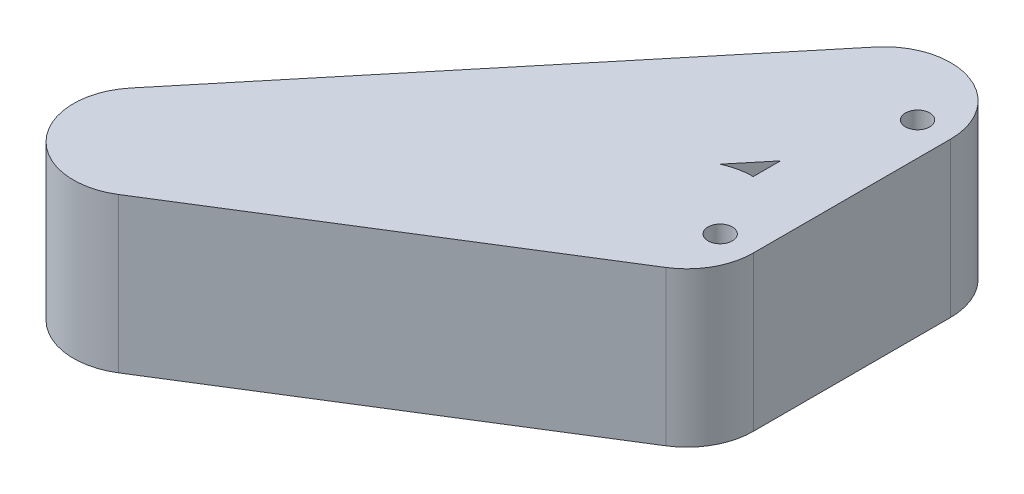
ISO-10303-21;
HEADER;
FILE_DESCRIPTION(('STEP AP214'),'2;1');
FILE_NAME('part.step','',(''),(''),'','','');
FILE_SCHEMA(('AUTOMOTIVE_DESIGN { 1 0 10303 214 1 1 1 1 }'));
ENDSEC;
DATA;
#1=APPLICATION_CONTEXT('core data for automotive mechanical design processes');
#2=APPLICATION_PROTOCOL_DEFINITION('international standard','automotive_design',2000,#1);
#3=PRODUCT_CONTEXT('',#1,'mechanical');
#4=PRODUCT('Part','Part','',(#3));
#5=PRODUCT_RELATED_PRODUCT_CATEGORY('part','',(#4));
#6=PRODUCT_DEFINITION_FORMATION('','',#4);
#7=PRODUCT_DEFINITION_CONTEXT('part definition',#1,'design');
#8=PRODUCT_DEFINITION('design','',#6,#7);
#9=PRODUCT_DEFINITION_SHAPE('','',#8);
#10=(LENGTH_UNIT() NAMED_UNIT(*) SI_UNIT(.MILLI.,.METRE.));
#11=(NAMED_UNIT(*) PLANE_ANGLE_UNIT() SI_UNIT($,.RADIAN.));
#12=(NAMED_UNIT(*) SI_UNIT($,.STERADIAN.) SOLID_ANGLE_UNIT());
#13=UNCERTAINTY_MEASURE_WITH_UNIT(LENGTH_MEASURE(1.E-05),#10,'distance_accuracy_value','');
#14=(GEOMETRIC_REPRESENTATION_CONTEXT(3) GLOBAL_UNCERTAINTY_ASSIGNED_CONTEXT((#13)) GLOBAL_UNIT_ASSIGNED_CONTEXT((#10,
#11,#12)) REPRESENTATION_CONTEXT('',''));
#15=CARTESIAN_POINT('',(0.,0.,0.));
#16=DIRECTION('',(0.,0.,1.));
#17=DIRECTION('',(1.,0.,0.));
#18=AXIS2_PLACEMENT_3D('',#15,#16,#17);
#19=CARTESIAN_POINT('',(-7.49999999999999,35.,0.));
#20=DIRECTION('',(1.,0.,0.));
#21=DIRECTION('',(0.,0.,-1.));
#22=AXIS2_PLACEMENT_3D('',#19,#20,#21);
#23=PLANE('',#22);
#24=DIRECTION('',(0.,1.,0.));
#25=VECTOR('',#24,1.);
#26=CARTESIAN_POINT('',(-7.5,35.,-21.164686488254));
#27=LINE('',#26,#25);
#28=CARTESIAN_POINT('',(-7.5,0.,-21.164686488254));
#29=VERTEX_POINT('',#28);
#30=CARTESIAN_POINT('',(-7.5,35.,-21.164686488254));
#31=VERTEX_POINT('',#30);
#32=EDGE_CURVE('E52',#29,#31,#27,.T.);
#33=ORIENTED_EDGE('',*,*,#32,.F.);
#34=DIRECTION('',(0.,0.,1.));
#35=VECTOR('',#34,1.);
#36=CARTESIAN_POINT('',(-7.49999999999999,0.,0.));
#37=LINE('',#36,#35);
#38=CARTESIAN_POINT('',(-7.5,0.,-15.));
#39=VERTEX_POINT('',#38);
#40=EDGE_CURVE('E181',#29,#39,#37,.T.);
#41=ORIENTED_EDGE('',*,*,#40,.T.);
#42=DIRECTION('',(0.,-1.,0.));
#43=VECTOR('',#42,1.);
#44=CARTESIAN_POINT('',(-7.5,35.,-15.));
#45=LINE('',#44,#43);
#46=CARTESIAN_POINT('',(-7.5,35.,-15.));
#47=VERTEX_POINT('',#46);
#48=EDGE_CURVE('E155',#39,#47,#45,.F.);
#49=ORIENTED_EDGE('',*,*,#48,.T.);
#50=DIRECTION('',(0.,0.,1.));
#51=VECTOR('',#50,1.);
#52=CARTESIAN_POINT('',(-7.49999999999999,35.,0.));
#53=LINE('',#52,#51);
#54=EDGE_CURVE('E48',#31,#47,#53,.T.);
#55=ORIENTED_EDGE('',*,*,#54,.F.);
#56=EDGE_LOOP('',(#33,#41,#49,#55));
#57=FACE_BOUND('',#56,.T.);
#58=ADVANCED_FACE('F33',(#57),#23,.F.);
#59=CARTESIAN_POINT('',(7.50000000000001,35.,0.));
#60=DIRECTION('',(1.,0.,0.));
#61=DIRECTION('',(0.,0.,-1.));
#62=AXIS2_PLACEMENT_3D('',#59,#60,#61);
#63=PLANE('',#62);
#64=DIRECTION('',(0.,0.,1.));
#65=VECTOR('',#64,1.);
#66=CARTESIAN_POINT('',(7.50000000000001,0.,0.));
#67=LINE('',#66,#65);
#68=CARTESIAN_POINT('',(7.5,0.,-44.72));
#69=VERTEX_POINT('',#68);
#70=CARTESIAN_POINT('',(7.50000000000001,0.,0.));
#71=VERTEX_POINT('',#70);
#72=EDGE_CURVE('E169',#69,#71,#67,.T.);
#73=ORIENTED_EDGE('',*,*,#72,.F.);
#74=DIRECTION('',(0.,-1.,0.));
#75=VECTOR('',#74,1.);
#76=CARTESIAN_POINT('',(7.5,35.,-44.72));
#77=LINE('',#76,#75);
#78=CARTESIAN_POINT('',(7.5,35.,-44.72));
#79=VERTEX_POINT('',#78);
#80=EDGE_CURVE('E41',#79,#69,#77,.T.);
#81=ORIENTED_EDGE('',*,*,#80,.F.);
#82=DIRECTION('',(0.,0.,1.));
#83=VECTOR('',#82,1.);
#84=CARTESIAN_POINT('',(7.50000000000001,35.,0.));
#85=LINE('',#84,#83);
#86=CARTESIAN_POINT('',(7.49999999999999,35.,0.));
#87=VERTEX_POINT('',#86);
#88=EDGE_CURVE('E173',#79,#87,#85,.T.);
#89=ORIENTED_EDGE('',*,*,#88,.T.);
#90=DIRECTION('',(0.,-1.,0.));
#91=VECTOR('',#90,1.);
#92=CARTESIAN_POINT('',(7.50000000000001,35.,0.));
#93=LINE('',#92,#91);
#94=EDGE_CURVE('E11',#87,#71,#93,.T.);
#95=ORIENTED_EDGE('',*,*,#94,.T.);
#96=EDGE_LOOP('',(#73,#81,#89,#95));
#97=FACE_BOUND('',#96,.T.);
#98=ADVANCED_FACE('F203',(#97),#63,.T.);
#99=CARTESIAN_POINT('',(0.,35.,0.));
#100=DIRECTION('',(0.,-1.,0.));
#101=DIRECTION('',(0.,0.,-1.));
#102=AXIS2_PLACEMENT_3D('',#99,#100,#101);
#103=CYLINDRICAL_SURFACE('',#102,2.75);
#104=CARTESIAN_POINT('',(0.,35.,0.));
#105=DIRECTION('',(0.,1.,0.));
#106=DIRECTION('',(0.,0.,1.));
#107=AXIS2_PLACEMENT_3D('',#104,#105,#106);
#108=CIRCLE('',#107,2.75);
#109=CARTESIAN_POINT('',(0.,35.,2.75));
#110=VERTEX_POINT('',#109);
#111=EDGE_CURVE('E168',#110,#110,#108,.T.);
#112=ORIENTED_EDGE('',*,*,#111,.T.);
#113=EDGE_LOOP('',(#112));
#114=FACE_BOUND('',#113,.T.);
#115=CARTESIAN_POINT('',(0.,0.,0.));
#116=DIRECTION('',(0.,1.,0.));
#117=DIRECTION('',(0.,0.,1.));
#118=AXIS2_PLACEMENT_3D('',#115,#116,#117);
#119=CIRCLE('',#118,2.75);
#120=CARTESIAN_POINT('',(0.,0.,2.75));
#121=VERTEX_POINT('',#120);
#122=EDGE_CURVE('E178',#121,#121,#119,.T.);
#123=ORIENTED_EDGE('',*,*,#122,.F.);
#124=EDGE_LOOP('',(#123));
#125=FACE_BOUND('',#124,.T.);
#126=ADVANCED_FACE('F225',(#114,#125),#103,.F.);
#127=CARTESIAN_POINT('',(0.,35.,-44.72));
#128=DIRECTION('',(0.,-1.,0.));
#129=DIRECTION('',(0.,0.,-1.));
#130=AXIS2_PLACEMENT_3D('',#127,#128,#129);
#131=CYLINDRICAL_SURFACE('',#130,2.75);
#132=CARTESIAN_POINT('',(0.,35.,-44.72));
#133=DIRECTION('',(0.,1.,0.));
#134=DIRECTION('',(0.,0.,1.));
#135=AXIS2_PLACEMENT_3D('',#132,#133,#134);
#136=CIRCLE('',#135,2.75);
#137=CARTESIAN_POINT('',(0.,35.,-41.97));
#138=VERTEX_POINT('',#137);
#139=EDGE_CURVE('E165',#138,#138,#136,.T.);
#140=ORIENTED_EDGE('',*,*,#139,.T.);
#141=EDGE_LOOP('',(#140));
#142=FACE_BOUND('',#141,.T.);
#143=CARTESIAN_POINT('',(0.,0.,-44.72));
#144=DIRECTION('',(0.,1.,0.));
#145=DIRECTION('',(0.,0.,1.));
#146=AXIS2_PLACEMENT_3D('',#143,#144,#145);
#147=CIRCLE('',#146,2.75);
#148=CARTESIAN_POINT('',(0.,0.,-41.97));
#149=VERTEX_POINT('',#148);
#150=EDGE_CURVE('E164',#149,#149,#147,.T.);
#151=ORIENTED_EDGE('',*,*,#150,.F.);
#152=EDGE_LOOP('',(#151));
#153=FACE_BOUND('',#152,.T.);
#154=ADVANCED_FACE('F35',(#142,#153),#131,.F.);
#155=CARTESIAN_POINT('',(0.,35.,0.));
#156=DIRECTION('',(0.,1.,0.));
#157=DIRECTION('',(0.,0.,1.));
#158=AXIS2_PLACEMENT_3D('',#155,#156,#157);
#159=PLANE('',#158);
#160=DIRECTION('',(0.636798996223087,0.,-0.771029855718486));
#161=VECTOR('',#160,1.);
#162=CARTESIAN_POINT('',(-14.8503241796823,35.,-12.2649874853379));
#163=LINE('',#162,#161);
#164=CARTESIAN_POINT('',(-13.6987999177016,35.,-13.6592415448407));
#165=VERTEX_POINT('',#164);
#166=EDGE_CURVE('E117',#165,#31,#163,.T.);
#167=ORIENTED_EDGE('',*,*,#166,.T.);
#168=ORIENTED_EDGE('',*,*,#54,.T.);
#169=CARTESIAN_POINT('',(-7.49999999999999,35.,0.));
#170=DIRECTION('',(0.,-1.,0.));
#171=DIRECTION('',(0.,0.,-1.));
#172=AXIS2_PLACEMENT_3D('',#169,#170,#171);
#173=CIRCLE('',#172,15.);
#174=EDGE_CURVE('E107',#165,#47,#173,.T.);
#175=ORIENTED_EDGE('',*,*,#174,.F.);
#176=EDGE_LOOP('',(#167,#168,#175));
#177=FACE_BOUND('',#176,.T.);
#178=CARTESIAN_POINT('',(0.448788963497994,35.,12.7207214423464));
#179=VERTEX_POINT('',#178);
#180=EDGE_CURVE('E120',#87,#179,#173,.T.);
#181=ORIENTED_EDGE('',*,*,#180,.F.);
#182=ORIENTED_EDGE('',*,*,#88,.F.);
#183=CARTESIAN_POINT('',(-7.50000000000001,35.,-44.72));
#184=DIRECTION('',(0.,-1.,0.));
#185=DIRECTION('',(0.,0.,-1.));
#186=AXIS2_PLACEMENT_3D('',#183,#184,#185);
#187=CIRCLE('',#186,15.);
#188=CARTESIAN_POINT('',(-19.0654478357773,35.,-54.2719849433463));
#189=VERTEX_POINT('',#188);
#190=EDGE_CURVE('E114',#189,#79,#187,.T.);
#191=ORIENTED_EDGE('',*,*,#190,.F.);
#192=DIRECTION('',(0.636798996223087,0.,-0.771029855718486));
#193=VECTOR('',#192,1.);
#194=CARTESIAN_POINT('',(-37.9812198512369,35.,-31.3689573720305));
#195=LINE('',#194,#193);
#196=CARTESIAN_POINT('',(-95.3897764898559,35.,38.1407488376417));
#197=VERTEX_POINT('',#196);
#198=EDGE_CURVE('E133',#197,#189,#195,.T.);
#199=ORIENTED_EDGE('',*,*,#198,.F.);
#200=CARTESIAN_POINT('',(-83.8243286540786,35.,47.692733780988));
#201=DIRECTION('',(0.,-1.,0.));
#202=DIRECTION('',(0.,0.,-1.));
#203=AXIS2_PLACEMENT_3D('',#200,#201,#202);
#204=CIRCLE('',#203,15.);
#205=CARTESIAN_POINT('',(-75.8755396905806,35.,60.4134552233344));
#206=VERTEX_POINT('',#205);
#207=EDGE_CURVE('E128',#206,#197,#204,.T.);
#208=ORIENTED_EDGE('',*,*,#207,.F.);
#209=DIRECTION('',(0.848048096156429,0.,-0.5299192642332));
#210=VECTOR('',#209,1.);
#211=CARTESIAN_POINT('',(5.84268076395707,35.,9.35024376872457));
#212=LINE('',#211,#210);
#213=EDGE_CURVE('E125',#206,#179,#212,.T.);
#214=ORIENTED_EDGE('',*,*,#213,.T.);
#215=EDGE_LOOP('',(#181,#182,#191,#199,#208,#214));
#216=FACE_BOUND('',#215,.T.);
#217=ORIENTED_EDGE('',*,*,#139,.F.);
#218=EDGE_LOOP('',(#217));
#219=FACE_BOUND('',#218,.T.);
#220=ORIENTED_EDGE('',*,*,#111,.F.);
#221=EDGE_LOOP('',(#220));
#222=FACE_BOUND('',#221,.T.);
#223=ADVANCED_FACE('F123',(#177,#216,#219,#222),#159,.T.);
#224=CARTESIAN_POINT('',(0.,0.,0.));
#225=DIRECTION('',(0.,1.,0.));
#226=DIRECTION('',(0.,0.,1.));
#227=AXIS2_PLACEMENT_3D('',#224,#225,#226);
#228=PLANE('',#227);
#229=ORIENTED_EDGE('',*,*,#40,.F.);
#230=DIRECTION('',(0.636798996223087,0.,-0.771029855718486));
#231=VECTOR('',#230,1.);
#232=CARTESIAN_POINT('',(-14.8503241796823,0.,-12.2649874853379));
#233=LINE('',#232,#231);
#234=CARTESIAN_POINT('',(-13.6987999177016,0.,-13.6592415448407));
#235=VERTEX_POINT('',#234);
#236=EDGE_CURVE('E138',#235,#29,#233,.T.);
#237=ORIENTED_EDGE('',*,*,#236,.F.);
#238=CARTESIAN_POINT('',(-7.49999999999999,0.,0.));
#239=DIRECTION('',(0.,-1.,0.));
#240=DIRECTION('',(0.,0.,-1.));
#241=AXIS2_PLACEMENT_3D('',#238,#239,#240);
#242=CIRCLE('',#241,15.);
#243=EDGE_CURVE('E109',#235,#39,#242,.T.);
#244=ORIENTED_EDGE('',*,*,#243,.T.);
#245=EDGE_LOOP('',(#229,#237,#244));
#246=FACE_BOUND('',#245,.T.);
#247=ORIENTED_EDGE('',*,*,#72,.T.);
#248=CARTESIAN_POINT('',(0.448788963497994,0.,12.7207214423464));
#249=VERTEX_POINT('',#248);
#250=EDGE_CURVE('E140',#71,#249,#242,.T.);
#251=ORIENTED_EDGE('',*,*,#250,.T.);
#252=DIRECTION('',(0.848048096156429,0.,-0.5299192642332));
#253=VECTOR('',#252,1.);
#254=CARTESIAN_POINT('',(5.84268076395707,0.,9.35024376872457));
#255=LINE('',#254,#253);
#256=CARTESIAN_POINT('',(-75.8755396905806,0.,60.4134552233344));
#257=VERTEX_POINT('',#256);
#258=EDGE_CURVE('E142',#257,#249,#255,.T.);
#259=ORIENTED_EDGE('',*,*,#258,.F.);
#260=CARTESIAN_POINT('',(-83.8243286540786,0.,47.692733780988));
#261=DIRECTION('',(0.,-1.,0.));
#262=DIRECTION('',(0.,0.,-1.));
#263=AXIS2_PLACEMENT_3D('',#260,#261,#262);
#264=CIRCLE('',#263,15.);
#265=CARTESIAN_POINT('',(-95.3897764898559,0.,38.1407488376417));
#266=VERTEX_POINT('',#265);
#267=EDGE_CURVE('E145',#257,#266,#264,.T.);
#268=ORIENTED_EDGE('',*,*,#267,.T.);
#269=DIRECTION('',(0.636798996223087,0.,-0.771029855718486));
#270=VECTOR('',#269,1.);
#271=CARTESIAN_POINT('',(-37.9812198512369,0.,-31.3689573720305));
#272=LINE('',#271,#270);
#273=CARTESIAN_POINT('',(-19.0654478357773,0.,-54.2719849433463));
#274=VERTEX_POINT('',#273);
#275=EDGE_CURVE('E148',#266,#274,#272,.T.);
#276=ORIENTED_EDGE('',*,*,#275,.T.);
#277=CARTESIAN_POINT('',(-7.50000000000001,0.,-44.72));
#278=DIRECTION('',(0.,-1.,0.));
#279=DIRECTION('',(0.,0.,-1.));
#280=AXIS2_PLACEMENT_3D('',#277,#278,#279);
#281=CIRCLE('',#280,15.);
#282=EDGE_CURVE('E121',#274,#69,#281,.T.);
#283=ORIENTED_EDGE('',*,*,#282,.T.);
#284=EDGE_LOOP('',(#247,#251,#259,#268,#276,#283));
#285=FACE_BOUND('',#284,.T.);
#286=ORIENTED_EDGE('',*,*,#150,.T.);
#287=EDGE_LOOP('',(#286));
#288=FACE_BOUND('',#287,.T.);
#289=ORIENTED_EDGE('',*,*,#122,.T.);
#290=EDGE_LOOP('',(#289));
#291=FACE_BOUND('',#290,.T.);
#292=ADVANCED_FACE('F192',(#246,#285,#288,#291),#228,.F.);
#293=CARTESIAN_POINT('',(-14.8503241796823,35.,-12.2649874853379));
#294=DIRECTION('',(-0.771029855718486,0.,-0.636798996223087));
#295=DIRECTION('',(-0.636798996223087,0.,0.771029855718486));
#296=AXIS2_PLACEMENT_3D('',#293,#294,#295);
#297=PLANE('',#296);
#298=ORIENTED_EDGE('',*,*,#236,.T.);
#299=ORIENTED_EDGE('',*,*,#32,.T.);
#300=ORIENTED_EDGE('',*,*,#166,.F.);
#301=DIRECTION('',(0.,-1.,0.));
#302=VECTOR('',#301,1.);
#303=CARTESIAN_POINT('',(-13.6987999177016,35.,-13.6592415448407));
#304=LINE('',#303,#302);
#305=EDGE_CURVE('E103',#165,#235,#304,.T.);
#306=ORIENTED_EDGE('',*,*,#305,.T.);
#307=EDGE_LOOP('',(#298,#299,#300,#306));
#308=FACE_BOUND('',#307,.T.);
#309=ADVANCED_FACE('F118',(#308),#297,.F.);
#310=CARTESIAN_POINT('',(-7.49999999999999,35.,0.));
#311=DIRECTION('',(0.,-1.,0.));
#312=DIRECTION('',(0.,0.,-1.));
#313=AXIS2_PLACEMENT_3D('',#310,#311,#312);
#314=CYLINDRICAL_SURFACE('',#313,15.);
#315=ORIENTED_EDGE('',*,*,#48,.F.);
#316=ORIENTED_EDGE('',*,*,#243,.F.);
#317=ORIENTED_EDGE('',*,*,#305,.F.);
#318=ORIENTED_EDGE('',*,*,#174,.T.);
#319=EDGE_LOOP('',(#315,#316,#317,#318));
#320=FACE_BOUND('',#319,.T.);
#321=ADVANCED_FACE('F105',(#320),#314,.T.);
#322=ORIENTED_EDGE('',*,*,#94,.F.);
#323=ORIENTED_EDGE('',*,*,#180,.T.);
#324=DIRECTION('',(0.,-1.,0.));
#325=VECTOR('',#324,1.);
#326=CARTESIAN_POINT('',(0.448788963497994,35.,12.7207214423464));
#327=LINE('',#326,#325);
#328=EDGE_CURVE('E113',#179,#249,#327,.T.);
#329=ORIENTED_EDGE('',*,*,#328,.T.);
#330=ORIENTED_EDGE('',*,*,#250,.F.);
#331=EDGE_LOOP('',(#322,#323,#329,#330));
#332=FACE_BOUND('',#331,.T.);
#333=ADVANCED_FACE('F205',(#332),#314,.T.);
#334=CARTESIAN_POINT('',(-7.50000000000001,35.,-44.72));
#335=DIRECTION('',(0.,-1.,0.));
#336=DIRECTION('',(0.,0.,-1.));
#337=AXIS2_PLACEMENT_3D('',#334,#335,#336);
#338=CYLINDRICAL_SURFACE('',#337,15.);
#339=ORIENTED_EDGE('',*,*,#190,.T.);
#340=ORIENTED_EDGE('',*,*,#80,.T.);
#341=ORIENTED_EDGE('',*,*,#282,.F.);
#342=DIRECTION('',(0.,-1.,0.));
#343=VECTOR('',#342,1.);
#344=CARTESIAN_POINT('',(-19.0654478357773,35.,-54.2719849433463));
#345=LINE('',#344,#343);
#346=EDGE_CURVE('E153',#189,#274,#345,.T.);
#347=ORIENTED_EDGE('',*,*,#346,.F.);
#348=EDGE_LOOP('',(#339,#340,#341,#347));
#349=FACE_BOUND('',#348,.T.);
#350=ADVANCED_FACE('F187',(#349),#338,.T.);
#351=CARTESIAN_POINT('',(-37.9812198512369,35.,-31.3689573720305));
#352=DIRECTION('',(-0.771029855718486,0.,-0.636798996223087));
#353=DIRECTION('',(-0.636798996223087,0.,0.771029855718486));
#354=AXIS2_PLACEMENT_3D('',#351,#352,#353);
#355=PLANE('',#354);
#356=ORIENTED_EDGE('',*,*,#275,.F.);
#357=DIRECTION('',(0.,-1.,0.));
#358=VECTOR('',#357,1.);
#359=CARTESIAN_POINT('',(-95.3897764898559,35.,38.1407488376417));
#360=LINE('',#359,#358);
#361=EDGE_CURVE('E156',#197,#266,#360,.T.);
#362=ORIENTED_EDGE('',*,*,#361,.F.);
#363=ORIENTED_EDGE('',*,*,#198,.T.);
#364=ORIENTED_EDGE('',*,*,#346,.T.);
#365=EDGE_LOOP('',(#356,#362,#363,#364));
#366=FACE_BOUND('',#365,.T.);
#367=ADVANCED_FACE('F198',(#366),#355,.T.);
#368=CARTESIAN_POINT('',(-83.8243286540786,35.,47.692733780988));
#369=DIRECTION('',(0.,-1.,0.));
#370=DIRECTION('',(0.,0.,-1.));
#371=AXIS2_PLACEMENT_3D('',#368,#369,#370);
#372=CYLINDRICAL_SURFACE('',#371,15.);
#373=ORIENTED_EDGE('',*,*,#267,.F.);
#374=DIRECTION('',(0.,-1.,0.));
#375=VECTOR('',#374,1.);
#376=CARTESIAN_POINT('',(-75.8755396905806,35.,60.4134552233344));
#377=LINE('',#376,#375);
#378=EDGE_CURVE('E158',#206,#257,#377,.T.);
#379=ORIENTED_EDGE('',*,*,#378,.F.);
#380=ORIENTED_EDGE('',*,*,#207,.T.);
#381=ORIENTED_EDGE('',*,*,#361,.T.);
#382=EDGE_LOOP('',(#373,#379,#380,#381));
#383=FACE_BOUND('',#382,.T.);
#384=ADVANCED_FACE('F209',(#383),#372,.T.);
#385=CARTESIAN_POINT('',(5.84268076395707,35.,9.35024376872457));
#386=DIRECTION('',(-0.5299192642332,0.,-0.848048096156429));
#387=DIRECTION('',(-0.848048096156429,0.,0.5299192642332));
#388=AXIS2_PLACEMENT_3D('',#385,#386,#387);
#389=PLANE('',#388);
#390=ORIENTED_EDGE('',*,*,#258,.T.);
#391=ORIENTED_EDGE('',*,*,#328,.F.);
#392=ORIENTED_EDGE('',*,*,#213,.F.);
#393=ORIENTED_EDGE('',*,*,#378,.T.);
#394=EDGE_LOOP('',(#390,#391,#392,#393));
#395=FACE_BOUND('',#394,.T.);
#396=ADVANCED_FACE('F211',(#395),#389,.F.);
#397=CLOSED_SHELL('',(#58,#98,#126,#154,#223,#292,#309,#321,#333,#350,#367,#384,#396));
#398=MANIFOLD_SOLID_BREP('B2',#397);
#399=ADVANCED_BREP_SHAPE_REPRESENTATION('',(#18,#398),#14);
#400=SHAPE_DEFINITION_REPRESENTATION(#9,#399);
ENDSEC;
END-ISO-10303-21;
